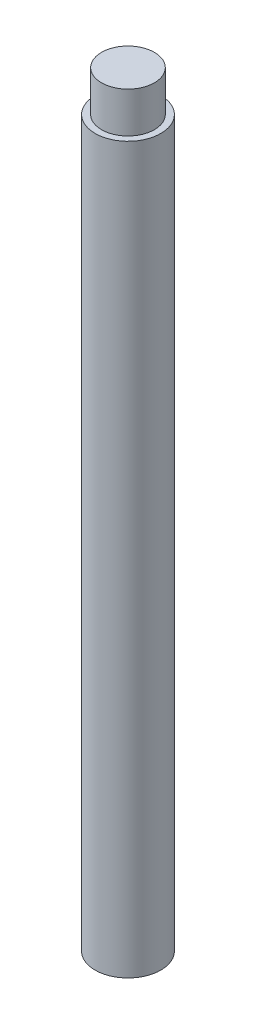
ISO-10303-21;
HEADER;
FILE_DESCRIPTION(('STEP AP214'),'2;1');
FILE_NAME('part.step','',(''),(''),'','','');
FILE_SCHEMA(('AUTOMOTIVE_DESIGN { 1 0 10303 214 1 1 1 1 }'));
ENDSEC;
DATA;
#1=APPLICATION_CONTEXT('core data for automotive mechanical design processes');
#2=APPLICATION_PROTOCOL_DEFINITION('international standard','automotive_design',2000,#1);
#3=PRODUCT_CONTEXT('',#1,'mechanical');
#4=PRODUCT('Part','Part','',(#3));
#5=PRODUCT_RELATED_PRODUCT_CATEGORY('part','',(#4));
#6=PRODUCT_DEFINITION_FORMATION('','',#4);
#7=PRODUCT_DEFINITION_CONTEXT('part definition',#1,'design');
#8=PRODUCT_DEFINITION('design','',#6,#7);
#9=PRODUCT_DEFINITION_SHAPE('','',#8);
#10=(LENGTH_UNIT() NAMED_UNIT(*) SI_UNIT(.MILLI.,.METRE.));
#11=(NAMED_UNIT(*) PLANE_ANGLE_UNIT() SI_UNIT($,.RADIAN.));
#12=(NAMED_UNIT(*) SI_UNIT($,.STERADIAN.) SOLID_ANGLE_UNIT());
#13=UNCERTAINTY_MEASURE_WITH_UNIT(LENGTH_MEASURE(1.E-05),#10,'distance_accuracy_value','');
#14=(GEOMETRIC_REPRESENTATION_CONTEXT(3) GLOBAL_UNCERTAINTY_ASSIGNED_CONTEXT((#13)) GLOBAL_UNIT_ASSIGNED_CONTEXT((#10,
#11,#12)) REPRESENTATION_CONTEXT('',''));
#15=CARTESIAN_POINT('',(0.,0.,0.));
#16=DIRECTION('',(0.,0.,1.));
#17=DIRECTION('',(1.,0.,0.));
#18=AXIS2_PLACEMENT_3D('',#15,#16,#17);
#19=CARTESIAN_POINT('',(0.,-52.5,0.));
#20=DIRECTION('',(0.,1.,0.));
#21=DIRECTION('',(0.,0.,1.));
#22=AXIS2_PLACEMENT_3D('',#19,#20,#21);
#23=PLANE('',#22);
#24=CARTESIAN_POINT('',(0.,-52.5,0.));
#25=DIRECTION('',(0.,-1.,0.));
#26=DIRECTION('',(0.,0.,-1.));
#27=AXIS2_PLACEMENT_3D('',#24,#25,#26);
#28=CIRCLE('',#27,4.);
#29=CARTESIAN_POINT('',(0.,-52.5,-4.));
#30=VERTEX_POINT('',#29);
#31=EDGE_CURVE('E66',#30,#30,#28,.T.);
#32=ORIENTED_EDGE('',*,*,#31,.F.);
#33=EDGE_LOOP('',(#32));
#34=FACE_BOUND('',#33,.T.);
#35=CARTESIAN_POINT('',(0.,-52.5,0.));
#36=DIRECTION('',(0.,1.,0.));
#37=DIRECTION('',(0.,0.,1.));
#38=AXIS2_PLACEMENT_3D('',#35,#36,#37);
#39=CIRCLE('',#38,4.85);
#40=CARTESIAN_POINT('',(0.,-52.5,4.85));
#41=VERTEX_POINT('',#40);
#42=EDGE_CURVE('E51',#41,#41,#39,.T.);
#43=ORIENTED_EDGE('',*,*,#42,.F.);
#44=EDGE_LOOP('',(#43));
#45=FACE_BOUND('',#44,.T.);
#46=ADVANCED_FACE('F39',(#34,#45),#23,.F.);
#47=CARTESIAN_POINT('',(0.,52.5,0.));
#48=DIRECTION('',(0.,-1.,0.));
#49=DIRECTION('',(0.,0.,-1.));
#50=AXIS2_PLACEMENT_3D('',#47,#48,#49);
#51=CYLINDRICAL_SURFACE('',#50,4.85);
#52=ORIENTED_EDGE('',*,*,#42,.T.);
#53=EDGE_LOOP('',(#52));
#54=FACE_BOUND('',#53,.T.);
#55=CARTESIAN_POINT('',(0.,54.5,0.));
#56=DIRECTION('',(0.,1.,0.));
#57=DIRECTION('',(0.,0.,1.));
#58=AXIS2_PLACEMENT_3D('',#55,#56,#57);
#59=CIRCLE('',#58,4.85);
#60=CARTESIAN_POINT('',(0.,54.5,4.85));
#61=VERTEX_POINT('',#60);
#62=EDGE_CURVE('E55',#61,#61,#59,.T.);
#63=ORIENTED_EDGE('',*,*,#62,.F.);
#64=EDGE_LOOP('',(#63));
#65=FACE_BOUND('',#64,.T.);
#66=ADVANCED_FACE('F74',(#54,#65),#51,.T.);
#67=CARTESIAN_POINT('',(0.,54.5,0.));
#68=DIRECTION('',(0.,1.,0.));
#69=DIRECTION('',(0.,0.,1.));
#70=AXIS2_PLACEMENT_3D('',#67,#68,#69);
#71=PLANE('',#70);
#72=CARTESIAN_POINT('',(0.,54.5,0.));
#73=DIRECTION('',(0.,1.,0.));
#74=DIRECTION('',(0.,0.,1.));
#75=AXIS2_PLACEMENT_3D('',#72,#73,#74);
#76=CIRCLE('',#75,3.9);
#77=CARTESIAN_POINT('',(0.,54.5,3.9));
#78=VERTEX_POINT('',#77);
#79=EDGE_CURVE('E58',#78,#78,#76,.F.);
#80=ORIENTED_EDGE('',*,*,#79,.T.);
#81=EDGE_LOOP('',(#80));
#82=FACE_BOUND('',#81,.T.);
#83=ORIENTED_EDGE('',*,*,#62,.T.);
#84=EDGE_LOOP('',(#83));
#85=FACE_BOUND('',#84,.T.);
#86=ADVANCED_FACE('F80',(#82,#85),#71,.T.);
#87=CARTESIAN_POINT('',(0.,60.5,0.));
#88=DIRECTION('',(0.,-1.,0.));
#89=DIRECTION('',(0.,0.,-1.));
#90=AXIS2_PLACEMENT_3D('',#87,#88,#89);
#91=CYLINDRICAL_SURFACE('',#90,3.9);
#92=ORIENTED_EDGE('',*,*,#79,.F.);
#93=EDGE_LOOP('',(#92));
#94=FACE_BOUND('',#93,.T.);
#95=CARTESIAN_POINT('',(0.,60.5,0.));
#96=DIRECTION('',(0.,1.,0.));
#97=DIRECTION('',(0.,0.,1.));
#98=AXIS2_PLACEMENT_3D('',#95,#96,#97);
#99=CIRCLE('',#98,3.9);
#100=CARTESIAN_POINT('',(0.,60.5,3.9));
#101=VERTEX_POINT('',#100);
#102=EDGE_CURVE('E60',#101,#101,#99,.T.);
#103=ORIENTED_EDGE('',*,*,#102,.F.);
#104=EDGE_LOOP('',(#103));
#105=FACE_BOUND('',#104,.T.);
#106=ADVANCED_FACE('F84',(#94,#105),#91,.T.);
#107=CARTESIAN_POINT('',(0.,60.5,0.));
#108=DIRECTION('',(0.,1.,0.));
#109=DIRECTION('',(0.,0.,1.));
#110=AXIS2_PLACEMENT_3D('',#107,#108,#109);
#111=PLANE('',#110);
#112=ORIENTED_EDGE('',*,*,#102,.T.);
#113=EDGE_LOOP('',(#112));
#114=FACE_BOUND('',#113,.T.);
#115=ADVANCED_FACE('F90',(#114),#111,.T.);
#116=CARTESIAN_POINT('',(0.,-38.5,0.));
#117=DIRECTION('',(0.,-1.,0.));
#118=DIRECTION('',(0.,0.,-1.));
#119=AXIS2_PLACEMENT_3D('',#116,#117,#118);
#120=CYLINDRICAL_SURFACE('',#119,4.);
#121=CARTESIAN_POINT('',(0.,-42.4,0.));
#122=DIRECTION('',(0.,-1.,0.));
#123=DIRECTION('',(0.,0.,-1.));
#124=AXIS2_PLACEMENT_3D('',#121,#122,#123);
#125=CIRCLE('',#124,4.);
#126=CARTESIAN_POINT('',(0.,-42.4,-4.));
#127=VERTEX_POINT('',#126);
#128=EDGE_CURVE('E10',#127,#127,#125,.F.);
#129=ORIENTED_EDGE('',*,*,#128,.T.);
#130=EDGE_LOOP('',(#129));
#131=FACE_BOUND('',#130,.T.);
#132=ORIENTED_EDGE('',*,*,#31,.T.);
#133=EDGE_LOOP('',(#132));
#134=FACE_BOUND('',#133,.T.);
#135=ADVANCED_FACE('F70',(#131,#134),#120,.F.);
#136=CARTESIAN_POINT('',(0.,-38.5,0.));
#137=DIRECTION('',(0.,-1.,0.));
#138=DIRECTION('',(0.,0.,-1.));
#139=AXIS2_PLACEMENT_3D('',#136,#137,#138);
#140=PLANE('',#139);
#141=CARTESIAN_POINT('',(0.,-38.5,0.));
#142=DIRECTION('',(0.,-1.,0.));
#143=DIRECTION('',(0.,0.,-1.));
#144=AXIS2_PLACEMENT_3D('',#141,#142,#143);
#145=CIRCLE('',#144,0.0999999999999335);
#146=CARTESIAN_POINT('',(0.,-38.5,-0.0999999999999335));
#147=VERTEX_POINT('',#146);
#148=EDGE_CURVE('E47',#147,#147,#145,.T.);
#149=ORIENTED_EDGE('',*,*,#148,.T.);
#150=EDGE_LOOP('',(#149));
#151=FACE_BOUND('',#150,.T.);
#152=ADVANCED_FACE('F99',(#151),#140,.T.);
#153=CARTESIAN_POINT('',(0.,-38.5,0.));
#154=DIRECTION('',(0.,-1.,0.));
#155=DIRECTION('',(0.,0.,-1.));
#156=AXIS2_PLACEMENT_3D('',#153,#154,#155);
#157=CONICAL_SURFACE('',#156,0.0999999999999335,0.785398163397454);
#158=ORIENTED_EDGE('',*,*,#128,.F.);
#159=EDGE_LOOP('',(#158));
#160=FACE_BOUND('',#159,.T.);
#161=ORIENTED_EDGE('',*,*,#148,.F.);
#162=EDGE_LOOP('',(#161));
#163=FACE_BOUND('',#162,.T.);
#164=ADVANCED_FACE('F42',(#160,#163),#157,.F.);
#165=CLOSED_SHELL('',(#46,#66,#86,#106,#115,#135,#152,#164));
#166=MANIFOLD_SOLID_BREP('B2',#165);
#167=ADVANCED_BREP_SHAPE_REPRESENTATION('',(#18,#166),#14);
#168=SHAPE_DEFINITION_REPRESENTATION(#9,#167);
ENDSEC;
END-ISO-10303-21;
